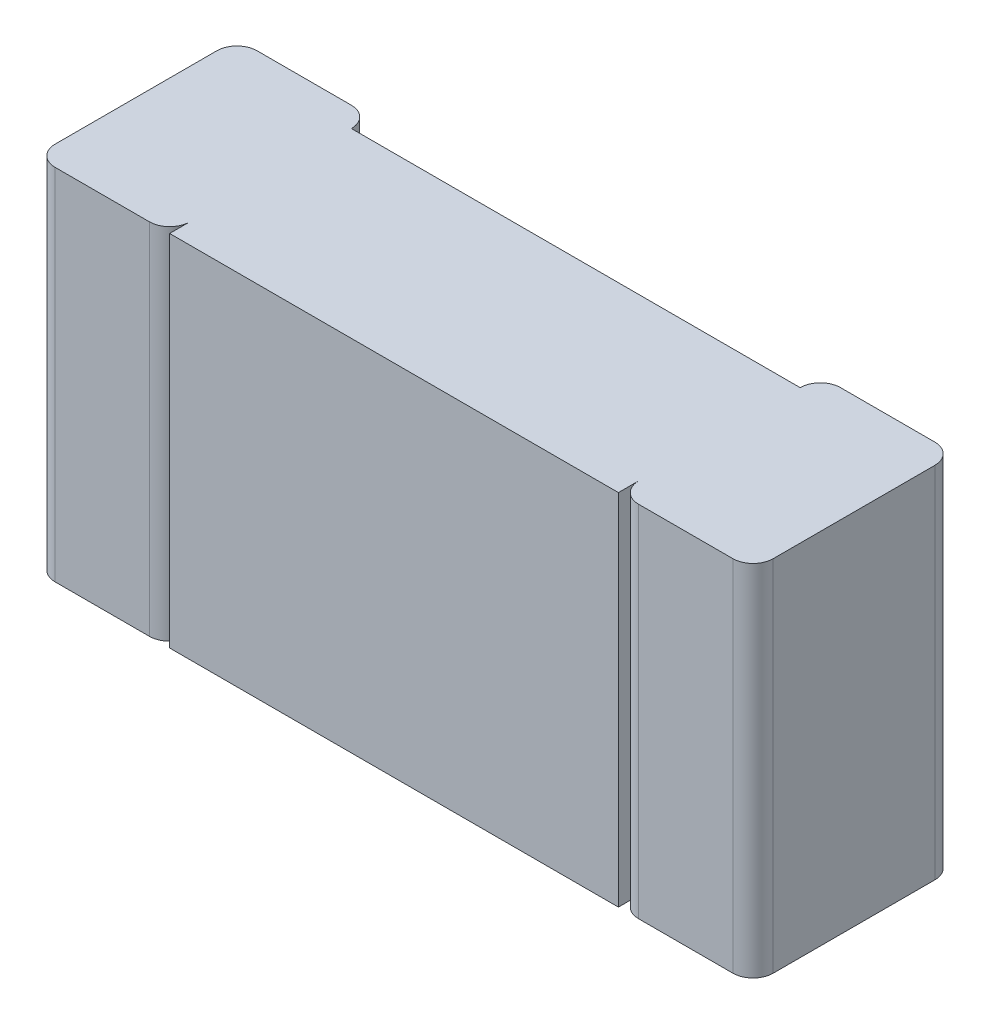
ISO-10303-21;
HEADER;
FILE_DESCRIPTION(('STEP AP214'),'2;1');
FILE_NAME('part.step','',(''),(''),'','','');
FILE_SCHEMA(('AUTOMOTIVE_DESIGN { 1 0 10303 214 1 1 1 1 }'));
ENDSEC;
DATA;
#1=APPLICATION_CONTEXT('core data for automotive mechanical design processes');
#2=APPLICATION_PROTOCOL_DEFINITION('international standard','automotive_design',2000,#1);
#3=PRODUCT_CONTEXT('',#1,'mechanical');
#4=PRODUCT('Part','Part','',(#3));
#5=PRODUCT_RELATED_PRODUCT_CATEGORY('part','',(#4));
#6=PRODUCT_DEFINITION_FORMATION('','',#4);
#7=PRODUCT_DEFINITION_CONTEXT('part definition',#1,'design');
#8=PRODUCT_DEFINITION('design','',#6,#7);
#9=PRODUCT_DEFINITION_SHAPE('','',#8);
#10=(LENGTH_UNIT() NAMED_UNIT(*) SI_UNIT(.MILLI.,.METRE.));
#11=(NAMED_UNIT(*) PLANE_ANGLE_UNIT() SI_UNIT($,.RADIAN.));
#12=(NAMED_UNIT(*) SI_UNIT($,.STERADIAN.) SOLID_ANGLE_UNIT());
#13=UNCERTAINTY_MEASURE_WITH_UNIT(LENGTH_MEASURE(1.E-05),#10,'distance_accuracy_value','');
#14=(GEOMETRIC_REPRESENTATION_CONTEXT(3) GLOBAL_UNCERTAINTY_ASSIGNED_CONTEXT((#13)) GLOBAL_UNIT_ASSIGNED_CONTEXT((#10,
#11,#12)) REPRESENTATION_CONTEXT('',''));
#15=CARTESIAN_POINT('',(0.,0.,0.));
#16=DIRECTION('',(0.,0.,1.));
#17=DIRECTION('',(1.,0.,0.));
#18=AXIS2_PLACEMENT_3D('',#15,#16,#17);
#19=CARTESIAN_POINT('',(-0.5,-0.4,0.45));
#20=DIRECTION('',(0.,0.,1.));
#21=DIRECTION('',(1.,0.,0.));
#22=AXIS2_PLACEMENT_3D('',#19,#20,#21);
#23=PLANE('',#22);
#24=DIRECTION('',(0.,1.,0.));
#25=VECTOR('',#24,1.);
#26=CARTESIAN_POINT('',(-0.5,-0.4,0.45));
#27=LINE('',#26,#25);
#28=CARTESIAN_POINT('',(-0.5,-0.4,0.45));
#29=VERTEX_POINT('',#28);
#30=CARTESIAN_POINT('',(-0.5,0.4,0.45));
#31=VERTEX_POINT('',#30);
#32=EDGE_CURVE('E356',#29,#31,#27,.T.);
#33=ORIENTED_EDGE('',*,*,#32,.F.);
#34=DIRECTION('',(1.,0.,0.));
#35=VECTOR('',#34,1.);
#36=CARTESIAN_POINT('',(-0.5,-0.4,0.45));
#37=LINE('',#36,#35);
#38=CARTESIAN_POINT('',(0.5,-0.4,0.45));
#39=VERTEX_POINT('',#38);
#40=EDGE_CURVE('E227',#29,#39,#37,.T.);
#41=ORIENTED_EDGE('',*,*,#40,.T.);
#42=DIRECTION('',(0.,1.,0.));
#43=VECTOR('',#42,1.);
#44=CARTESIAN_POINT('',(0.5,-0.4,0.45));
#45=LINE('',#44,#43);
#46=CARTESIAN_POINT('',(0.5,0.4,0.45));
#47=VERTEX_POINT('',#46);
#48=EDGE_CURVE('E11',#39,#47,#45,.T.);
#49=ORIENTED_EDGE('',*,*,#48,.T.);
#50=DIRECTION('',(1.,0.,0.));
#51=VECTOR('',#50,1.);
#52=CARTESIAN_POINT('',(-0.5,0.4,0.45));
#53=LINE('',#52,#51);
#54=EDGE_CURVE('E286',#31,#47,#53,.T.);
#55=ORIENTED_EDGE('',*,*,#54,.F.);
#56=EDGE_LOOP('',(#33,#41,#49,#55));
#57=FACE_BOUND('',#56,.T.);
#58=ADVANCED_FACE('F17',(#57),#23,.T.);
#59=CARTESIAN_POINT('',(0.5,-0.4,0.405));
#60=DIRECTION('',(1.,0.,0.));
#61=DIRECTION('',(0.,1.,0.));
#62=AXIS2_PLACEMENT_3D('',#59,#60,#61);
#63=PLANE('',#62);
#64=DIRECTION('',(0.,0.,1.));
#65=VECTOR('',#64,1.);
#66=CARTESIAN_POINT('',(0.5,-0.4,0.405));
#67=LINE('',#66,#65);
#68=CARTESIAN_POINT('',(0.5,-0.4,0.405));
#69=VERTEX_POINT('',#68);
#70=EDGE_CURVE('E231',#69,#39,#67,.T.);
#71=ORIENTED_EDGE('',*,*,#70,.F.);
#72=DIRECTION('',(0.,1.,0.));
#73=VECTOR('',#72,1.);
#74=CARTESIAN_POINT('',(0.5,-0.4,0.405));
#75=LINE('',#74,#73);
#76=CARTESIAN_POINT('',(0.5,0.4,0.405));
#77=VERTEX_POINT('',#76);
#78=EDGE_CURVE('E25',#69,#77,#75,.T.);
#79=ORIENTED_EDGE('',*,*,#78,.T.);
#80=DIRECTION('',(0.,0.,1.));
#81=VECTOR('',#80,1.);
#82=CARTESIAN_POINT('',(0.5,0.4,0.405));
#83=LINE('',#82,#81);
#84=EDGE_CURVE('E282',#77,#47,#83,.T.);
#85=ORIENTED_EDGE('',*,*,#84,.T.);
#86=ORIENTED_EDGE('',*,*,#48,.F.);
#87=EDGE_LOOP('',(#71,#79,#85,#86));
#88=FACE_BOUND('',#87,.T.);
#89=ADVANCED_FACE('F403',(#88),#63,.T.);
#90=CARTESIAN_POINT('',(0.545,-0.4,0.405));
#91=DIRECTION('',(0.,1.,0.));
#92=DIRECTION('',(-1.,0.,0.));
#93=AXIS2_PLACEMENT_3D('',#90,#91,#92);
#94=CYLINDRICAL_SURFACE('',#93,0.045);
#95=CARTESIAN_POINT('',(0.545,-0.4,0.405));
#96=DIRECTION('',(0.,1.,0.));
#97=DIRECTION('',(0.,0.,1.));
#98=AXIS2_PLACEMENT_3D('',#95,#96,#97);
#99=CIRCLE('',#98,0.045);
#100=CARTESIAN_POINT('',(0.545,-0.4,0.45));
#101=VERTEX_POINT('',#100);
#102=EDGE_CURVE('E335',#69,#101,#99,.T.);
#103=ORIENTED_EDGE('',*,*,#102,.T.);
#104=DIRECTION('',(0.,1.,0.));
#105=VECTOR('',#104,1.);
#106=CARTESIAN_POINT('',(0.545,-0.4,0.45));
#107=LINE('',#106,#105);
#108=CARTESIAN_POINT('',(0.545,0.4,0.45));
#109=VERTEX_POINT('',#108);
#110=EDGE_CURVE('E346',#101,#109,#107,.T.);
#111=ORIENTED_EDGE('',*,*,#110,.T.);
#112=CARTESIAN_POINT('',(0.545,0.4,0.405));
#113=DIRECTION('',(0.,1.,0.));
#114=DIRECTION('',(0.,0.,1.));
#115=AXIS2_PLACEMENT_3D('',#112,#113,#114);
#116=CIRCLE('',#115,0.045);
#117=EDGE_CURVE('E314',#77,#109,#116,.T.);
#118=ORIENTED_EDGE('',*,*,#117,.F.);
#119=ORIENTED_EDGE('',*,*,#78,.F.);
#120=EDGE_LOOP('',(#103,#111,#118,#119));
#121=FACE_BOUND('',#120,.T.);
#122=ADVANCED_FACE('F391',(#121),#94,.T.);
#123=CARTESIAN_POINT('',(0.5,-0.4,0.45));
#124=DIRECTION('',(0.,0.,1.));
#125=DIRECTION('',(1.,0.,0.));
#126=AXIS2_PLACEMENT_3D('',#123,#124,#125);
#127=PLANE('',#126);
#128=DIRECTION('',(1.,0.,0.));
#129=VECTOR('',#128,1.);
#130=CARTESIAN_POINT('',(0.5,0.4,0.45));
#131=LINE('',#130,#129);
#132=CARTESIAN_POINT('',(0.755,0.4,0.45));
#133=VERTEX_POINT('',#132);
#134=EDGE_CURVE('E243',#109,#133,#131,.T.);
#135=ORIENTED_EDGE('',*,*,#134,.F.);
#136=ORIENTED_EDGE('',*,*,#110,.F.);
#137=DIRECTION('',(1.,0.,0.));
#138=VECTOR('',#137,1.);
#139=CARTESIAN_POINT('',(0.5,-0.4,0.45));
#140=LINE('',#139,#138);
#141=CARTESIAN_POINT('',(0.755,-0.4,0.45));
#142=VERTEX_POINT('',#141);
#143=EDGE_CURVE('E331',#101,#142,#140,.T.);
#144=ORIENTED_EDGE('',*,*,#143,.T.);
#145=DIRECTION('',(0.,1.,0.));
#146=VECTOR('',#145,1.);
#147=CARTESIAN_POINT('',(0.755,-0.4,0.45));
#148=LINE('',#147,#146);
#149=EDGE_CURVE('E368',#142,#133,#148,.T.);
#150=ORIENTED_EDGE('',*,*,#149,.T.);
#151=EDGE_LOOP('',(#135,#136,#144,#150));
#152=FACE_BOUND('',#151,.T.);
#153=ADVANCED_FACE('F395',(#152),#127,.T.);
#154=CARTESIAN_POINT('',(0.755,-0.4,0.405));
#155=DIRECTION('',(0.,1.,0.));
#156=DIRECTION('',(1.,0.,0.));
#157=AXIS2_PLACEMENT_3D('',#154,#155,#156);
#158=CYLINDRICAL_SURFACE('',#157,0.045);
#159=DIRECTION('',(0.,1.,0.));
#160=VECTOR('',#159,1.);
#161=CARTESIAN_POINT('',(0.8,-0.4,0.405));
#162=LINE('',#161,#160);
#163=CARTESIAN_POINT('',(0.8,-0.4,0.405));
#164=VERTEX_POINT('',#163);
#165=CARTESIAN_POINT('',(0.8,0.4,0.405));
#166=VERTEX_POINT('',#165);
#167=EDGE_CURVE('E272',#164,#166,#162,.T.);
#168=ORIENTED_EDGE('',*,*,#167,.T.);
#169=CARTESIAN_POINT('',(0.755,0.4,0.405));
#170=DIRECTION('',(0.,-1.,0.));
#171=DIRECTION('',(0.,0.,1.));
#172=AXIS2_PLACEMENT_3D('',#169,#170,#171);
#173=CIRCLE('',#172,0.045);
#174=EDGE_CURVE('E238',#166,#133,#173,.T.);
#175=ORIENTED_EDGE('',*,*,#174,.T.);
#176=ORIENTED_EDGE('',*,*,#149,.F.);
#177=CARTESIAN_POINT('',(0.755,-0.4,0.405));
#178=DIRECTION('',(0.,-1.,0.));
#179=DIRECTION('',(0.,0.,1.));
#180=AXIS2_PLACEMENT_3D('',#177,#178,#179);
#181=CIRCLE('',#180,0.045);
#182=EDGE_CURVE('E330',#164,#142,#181,.T.);
#183=ORIENTED_EDGE('',*,*,#182,.F.);
#184=EDGE_LOOP('',(#168,#175,#176,#183));
#185=FACE_BOUND('',#184,.T.);
#186=ADVANCED_FACE('F434',(#185),#158,.T.);
#187=CARTESIAN_POINT('',(0.8,-0.4,0.));
#188=DIRECTION('',(1.,0.,0.));
#189=DIRECTION('',(0.,1.,0.));
#190=AXIS2_PLACEMENT_3D('',#187,#188,#189);
#191=PLANE('',#190);
#192=DIRECTION('',(0.,0.,1.));
#193=VECTOR('',#192,1.);
#194=CARTESIAN_POINT('',(0.8,-0.4,0.));
#195=LINE('',#194,#193);
#196=CARTESIAN_POINT('',(0.8,-0.4,0.045));
#197=VERTEX_POINT('',#196);
#198=EDGE_CURVE('E326',#197,#164,#195,.T.);
#199=ORIENTED_EDGE('',*,*,#198,.F.);
#200=DIRECTION('',(0.,1.,0.));
#201=VECTOR('',#200,1.);
#202=CARTESIAN_POINT('',(0.8,-0.4,0.045));
#203=LINE('',#202,#201);
#204=CARTESIAN_POINT('',(0.8,0.4,0.045));
#205=VERTEX_POINT('',#204);
#206=EDGE_CURVE('E45',#197,#205,#203,.T.);
#207=ORIENTED_EDGE('',*,*,#206,.T.);
#208=DIRECTION('',(0.,0.,1.));
#209=VECTOR('',#208,1.);
#210=CARTESIAN_POINT('',(0.8,0.4,0.));
#211=LINE('',#210,#209);
#212=EDGE_CURVE('E242',#205,#166,#211,.T.);
#213=ORIENTED_EDGE('',*,*,#212,.T.);
#214=ORIENTED_EDGE('',*,*,#167,.F.);
#215=EDGE_LOOP('',(#199,#207,#213,#214));
#216=FACE_BOUND('',#215,.T.);
#217=ADVANCED_FACE('F433',(#216),#191,.T.);
#218=CARTESIAN_POINT('',(0.755,-0.4,0.045));
#219=DIRECTION('',(0.,1.,0.));
#220=DIRECTION('',(1.,0.,0.));
#221=AXIS2_PLACEMENT_3D('',#218,#219,#220);
#222=CYLINDRICAL_SURFACE('',#221,0.045);
#223=CARTESIAN_POINT('',(0.755,-0.4,0.045));
#224=DIRECTION('',(0.,1.,0.));
#225=DIRECTION('',(0.,0.,1.));
#226=AXIS2_PLACEMENT_3D('',#223,#224,#225);
#227=CIRCLE('',#226,0.045);
#228=CARTESIAN_POINT('',(0.755,-0.4,0.));
#229=VERTEX_POINT('',#228);
#230=EDGE_CURVE('E322',#197,#229,#227,.T.);
#231=ORIENTED_EDGE('',*,*,#230,.T.);
#232=DIRECTION('',(0.,1.,0.));
#233=VECTOR('',#232,1.);
#234=CARTESIAN_POINT('',(0.755,-0.4,0.));
#235=LINE('',#234,#233);
#236=CARTESIAN_POINT('',(0.755,0.4,0.));
#237=VERTEX_POINT('',#236);
#238=EDGE_CURVE('E273',#229,#237,#235,.T.);
#239=ORIENTED_EDGE('',*,*,#238,.T.);
#240=CARTESIAN_POINT('',(0.755,0.4,0.045));
#241=DIRECTION('',(0.,1.,0.));
#242=DIRECTION('',(0.,0.,1.));
#243=AXIS2_PLACEMENT_3D('',#240,#241,#242);
#244=CIRCLE('',#243,0.045);
#245=EDGE_CURVE('E374',#205,#237,#244,.T.);
#246=ORIENTED_EDGE('',*,*,#245,.F.);
#247=ORIENTED_EDGE('',*,*,#206,.F.);
#248=EDGE_LOOP('',(#231,#239,#246,#247));
#249=FACE_BOUND('',#248,.T.);
#250=ADVANCED_FACE('F431',(#249),#222,.T.);
#251=CARTESIAN_POINT('',(0.5,-0.4,0.));
#252=DIRECTION('',(0.,0.,1.));
#253=DIRECTION('',(1.,0.,0.));
#254=AXIS2_PLACEMENT_3D('',#251,#252,#253);
#255=PLANE('',#254);
#256=ORIENTED_EDGE('',*,*,#238,.F.);
#257=DIRECTION('',(1.,0.,0.));
#258=VECTOR('',#257,1.);
#259=CARTESIAN_POINT('',(0.5,-0.4,0.));
#260=LINE('',#259,#258);
#261=CARTESIAN_POINT('',(0.545,-0.4,0.));
#262=VERTEX_POINT('',#261);
#263=EDGE_CURVE('E343',#262,#229,#260,.T.);
#264=ORIENTED_EDGE('',*,*,#263,.F.);
#265=DIRECTION('',(0.,1.,0.));
#266=VECTOR('',#265,1.);
#267=CARTESIAN_POINT('',(0.545,-0.4,0.));
#268=LINE('',#267,#266);
#269=CARTESIAN_POINT('',(0.545,0.4,0.));
#270=VERTEX_POINT('',#269);
#271=EDGE_CURVE('E285',#262,#270,#268,.T.);
#272=ORIENTED_EDGE('',*,*,#271,.T.);
#273=DIRECTION('',(1.,0.,0.));
#274=VECTOR('',#273,1.);
#275=CARTESIAN_POINT('',(0.5,0.4,0.));
#276=LINE('',#275,#274);
#277=EDGE_CURVE('E301',#270,#237,#276,.T.);
#278=ORIENTED_EDGE('',*,*,#277,.T.);
#279=EDGE_LOOP('',(#256,#264,#272,#278));
#280=FACE_BOUND('',#279,.T.);
#281=ADVANCED_FACE('F429',(#280),#255,.F.);
#282=CARTESIAN_POINT('',(0.545,-0.4,0.045));
#283=DIRECTION('',(0.,1.,0.));
#284=DIRECTION('',(-1.,0.,0.));
#285=AXIS2_PLACEMENT_3D('',#282,#283,#284);
#286=CYLINDRICAL_SURFACE('',#285,0.045);
#287=DIRECTION('',(0.,1.,0.));
#288=VECTOR('',#287,1.);
#289=CARTESIAN_POINT('',(0.5,-0.4,0.045));
#290=LINE('',#289,#288);
#291=CARTESIAN_POINT('',(0.5,-0.4,0.045));
#292=VERTEX_POINT('',#291);
#293=CARTESIAN_POINT('',(0.5,0.4,0.045));
#294=VERTEX_POINT('',#293);
#295=EDGE_CURVE('E318',#292,#294,#290,.T.);
#296=ORIENTED_EDGE('',*,*,#295,.T.);
#297=CARTESIAN_POINT('',(0.545,0.4,0.045));
#298=DIRECTION('',(0.,-1.,0.));
#299=DIRECTION('',(0.,0.,1.));
#300=AXIS2_PLACEMENT_3D('',#297,#298,#299);
#301=CIRCLE('',#300,0.045);
#302=EDGE_CURVE('E305',#294,#270,#301,.T.);
#303=ORIENTED_EDGE('',*,*,#302,.T.);
#304=ORIENTED_EDGE('',*,*,#271,.F.);
#305=CARTESIAN_POINT('',(0.545,-0.4,0.045));
#306=DIRECTION('',(0.,-1.,0.));
#307=DIRECTION('',(0.,0.,1.));
#308=AXIS2_PLACEMENT_3D('',#305,#306,#307);
#309=CIRCLE('',#308,0.045);
#310=EDGE_CURVE('E339',#292,#262,#309,.T.);
#311=ORIENTED_EDGE('',*,*,#310,.F.);
#312=EDGE_LOOP('',(#296,#303,#304,#311));
#313=FACE_BOUND('',#312,.T.);
#314=ADVANCED_FACE('F426',(#313),#286,.T.);
#315=CARTESIAN_POINT('',(-0.5,-0.4,0.405));
#316=DIRECTION('',(1.,0.,0.));
#317=DIRECTION('',(0.,1.,0.));
#318=AXIS2_PLACEMENT_3D('',#315,#316,#317);
#319=PLANE('',#318);
#320=ORIENTED_EDGE('',*,*,#32,.T.);
#321=DIRECTION('',(0.,0.,1.));
#322=VECTOR('',#321,1.);
#323=CARTESIAN_POINT('',(-0.5,0.4,0.405));
#324=LINE('',#323,#322);
#325=CARTESIAN_POINT('',(-0.5,0.4,0.405));
#326=VERTEX_POINT('',#325);
#327=EDGE_CURVE('E306',#326,#31,#324,.T.);
#328=ORIENTED_EDGE('',*,*,#327,.F.);
#329=DIRECTION('',(0.,1.,0.));
#330=VECTOR('',#329,1.);
#331=CARTESIAN_POINT('',(-0.5,-0.4,0.405));
#332=LINE('',#331,#330);
#333=CARTESIAN_POINT('',(-0.5,-0.4,0.405));
#334=VERTEX_POINT('',#333);
#335=EDGE_CURVE('E300',#334,#326,#332,.T.);
#336=ORIENTED_EDGE('',*,*,#335,.F.);
#337=DIRECTION('',(0.,0.,1.));
#338=VECTOR('',#337,1.);
#339=CARTESIAN_POINT('',(-0.5,-0.4,0.405));
#340=LINE('',#339,#338);
#341=EDGE_CURVE('E230',#334,#29,#340,.T.);
#342=ORIENTED_EDGE('',*,*,#341,.T.);
#343=EDGE_LOOP('',(#320,#328,#336,#342));
#344=FACE_BOUND('',#343,.T.);
#345=ADVANCED_FACE('F450',(#344),#319,.F.);
#346=CARTESIAN_POINT('',(-0.755,-0.4,0.045));
#347=DIRECTION('',(0.,0.,1.));
#348=DIRECTION('',(1.,0.,0.));
#349=AXIS2_PLACEMENT_3D('',#346,#347,#348);
#350=PLANE('',#349);
#351=DIRECTION('',(1.,0.,0.));
#352=VECTOR('',#351,1.);
#353=CARTESIAN_POINT('',(-0.755,0.4,0.045));
#354=LINE('',#353,#352);
#355=CARTESIAN_POINT('',(-0.5,0.4,0.045));
#356=VERTEX_POINT('',#355);
#357=EDGE_CURVE('E310',#356,#294,#354,.T.);
#358=ORIENTED_EDGE('',*,*,#357,.T.);
#359=ORIENTED_EDGE('',*,*,#295,.F.);
#360=DIRECTION('',(1.,0.,0.));
#361=VECTOR('',#360,1.);
#362=CARTESIAN_POINT('',(-0.755,-0.4,0.045));
#363=LINE('',#362,#361);
#364=CARTESIAN_POINT('',(-0.5,-0.4,0.045));
#365=VERTEX_POINT('',#364);
#366=EDGE_CURVE('E293',#365,#292,#363,.T.);
#367=ORIENTED_EDGE('',*,*,#366,.F.);
#368=DIRECTION('',(0.,1.,0.));
#369=VECTOR('',#368,1.);
#370=CARTESIAN_POINT('',(-0.5,-0.4,0.045));
#371=LINE('',#370,#369);
#372=EDGE_CURVE('E289',#365,#356,#371,.T.);
#373=ORIENTED_EDGE('',*,*,#372,.T.);
#374=EDGE_LOOP('',(#358,#359,#367,#373));
#375=FACE_BOUND('',#374,.T.);
#376=ADVANCED_FACE('F422',(#375),#350,.F.);
#377=CARTESIAN_POINT('',(-0.545,-0.4,0.405));
#378=DIRECTION('',(0.,1.,0.));
#379=DIRECTION('',(1.,0.,0.));
#380=AXIS2_PLACEMENT_3D('',#377,#378,#379);
#381=CYLINDRICAL_SURFACE('',#380,0.045);
#382=ORIENTED_EDGE('',*,*,#335,.T.);
#383=CARTESIAN_POINT('',(-0.545,0.4,0.405));
#384=DIRECTION('',(0.,-1.,0.));
#385=DIRECTION('',(0.,0.,1.));
#386=AXIS2_PLACEMENT_3D('',#383,#384,#385);
#387=CIRCLE('',#386,0.045);
#388=CARTESIAN_POINT('',(-0.545,0.4,0.45));
#389=VERTEX_POINT('',#388);
#390=EDGE_CURVE('E267',#326,#389,#387,.T.);
#391=ORIENTED_EDGE('',*,*,#390,.T.);
#392=DIRECTION('',(0.,1.,0.));
#393=VECTOR('',#392,1.);
#394=CARTESIAN_POINT('',(-0.545,-0.4,0.45));
#395=LINE('',#394,#393);
#396=CARTESIAN_POINT('',(-0.545,-0.4,0.45));
#397=VERTEX_POINT('',#396);
#398=EDGE_CURVE('E297',#397,#389,#395,.T.);
#399=ORIENTED_EDGE('',*,*,#398,.F.);
#400=CARTESIAN_POINT('',(-0.545,-0.4,0.405));
#401=DIRECTION('',(0.,-1.,0.));
#402=DIRECTION('',(0.,0.,1.));
#403=AXIS2_PLACEMENT_3D('',#400,#401,#402);
#404=CIRCLE('',#403,0.045);
#405=EDGE_CURVE('E237',#334,#397,#404,.T.);
#406=ORIENTED_EDGE('',*,*,#405,.F.);
#407=EDGE_LOOP('',(#382,#391,#399,#406));
#408=FACE_BOUND('',#407,.T.);
#409=ADVANCED_FACE('F453',(#408),#381,.T.);
#410=CARTESIAN_POINT('',(-0.8,-0.4,0.45));
#411=DIRECTION('',(0.,0.,1.));
#412=DIRECTION('',(1.,0.,0.));
#413=AXIS2_PLACEMENT_3D('',#410,#411,#412);
#414=PLANE('',#413);
#415=DIRECTION('',(1.,0.,0.));
#416=VECTOR('',#415,1.);
#417=CARTESIAN_POINT('',(-0.8,0.4,0.45));
#418=LINE('',#417,#416);
#419=CARTESIAN_POINT('',(-0.755,0.4,0.45));
#420=VERTEX_POINT('',#419);
#421=EDGE_CURVE('E256',#420,#389,#418,.T.);
#422=ORIENTED_EDGE('',*,*,#421,.F.);
#423=DIRECTION('',(0.,1.,0.));
#424=VECTOR('',#423,1.);
#425=CARTESIAN_POINT('',(-0.755,-0.4,0.45));
#426=LINE('',#425,#424);
#427=CARTESIAN_POINT('',(-0.755,-0.4,0.45));
#428=VERTEX_POINT('',#427);
#429=EDGE_CURVE('E261',#428,#420,#426,.T.);
#430=ORIENTED_EDGE('',*,*,#429,.F.);
#431=DIRECTION('',(1.,0.,0.));
#432=VECTOR('',#431,1.);
#433=CARTESIAN_POINT('',(-0.8,-0.4,0.45));
#434=LINE('',#433,#432);
#435=EDGE_CURVE('E193',#428,#397,#434,.T.);
#436=ORIENTED_EDGE('',*,*,#435,.T.);
#437=ORIENTED_EDGE('',*,*,#398,.T.);
#438=EDGE_LOOP('',(#422,#430,#436,#437));
#439=FACE_BOUND('',#438,.T.);
#440=ADVANCED_FACE('F455',(#439),#414,.T.);
#441=CARTESIAN_POINT('',(-0.545,-0.4,0.045));
#442=DIRECTION('',(0.,1.,0.));
#443=DIRECTION('',(1.,0.,0.));
#444=AXIS2_PLACEMENT_3D('',#441,#442,#443);
#445=CYLINDRICAL_SURFACE('',#444,0.045);
#446=CARTESIAN_POINT('',(-0.545,-0.4,0.045));
#447=DIRECTION('',(0.,1.,0.));
#448=DIRECTION('',(0.,0.,1.));
#449=AXIS2_PLACEMENT_3D('',#446,#447,#448);
#450=CIRCLE('',#449,0.045);
#451=CARTESIAN_POINT('',(-0.545,-0.4,0.));
#452=VERTEX_POINT('',#451);
#453=EDGE_CURVE('E208',#365,#452,#450,.T.);
#454=ORIENTED_EDGE('',*,*,#453,.T.);
#455=DIRECTION('',(0.,1.,0.));
#456=VECTOR('',#455,1.);
#457=CARTESIAN_POINT('',(-0.545,-0.4,0.));
#458=LINE('',#457,#456);
#459=CARTESIAN_POINT('',(-0.545,0.4,0.));
#460=VERTEX_POINT('',#459);
#461=EDGE_CURVE('E266',#452,#460,#458,.T.);
#462=ORIENTED_EDGE('',*,*,#461,.T.);
#463=CARTESIAN_POINT('',(-0.545,0.4,0.045));
#464=DIRECTION('',(0.,1.,0.));
#465=DIRECTION('',(0.,0.,1.));
#466=AXIS2_PLACEMENT_3D('',#463,#464,#465);
#467=CIRCLE('',#466,0.045);
#468=EDGE_CURVE('E262',#356,#460,#467,.T.);
#469=ORIENTED_EDGE('',*,*,#468,.F.);
#470=ORIENTED_EDGE('',*,*,#372,.F.);
#471=EDGE_LOOP('',(#454,#462,#469,#470));
#472=FACE_BOUND('',#471,.T.);
#473=ADVANCED_FACE('F419',(#472),#445,.T.);
#474=CARTESIAN_POINT('',(-0.8,-0.4,0.));
#475=DIRECTION('',(0.,0.,1.));
#476=DIRECTION('',(1.,0.,0.));
#477=AXIS2_PLACEMENT_3D('',#474,#475,#476);
#478=PLANE('',#477);
#479=ORIENTED_EDGE('',*,*,#461,.F.);
#480=DIRECTION('',(1.,0.,0.));
#481=VECTOR('',#480,1.);
#482=CARTESIAN_POINT('',(-0.8,-0.4,0.));
#483=LINE('',#482,#481);
#484=CARTESIAN_POINT('',(-0.755,-0.4,0.));
#485=VERTEX_POINT('',#484);
#486=EDGE_CURVE('E222',#485,#452,#483,.T.);
#487=ORIENTED_EDGE('',*,*,#486,.F.);
#488=DIRECTION('',(0.,1.,0.));
#489=VECTOR('',#488,1.);
#490=CARTESIAN_POINT('',(-0.755,-0.4,0.));
#491=LINE('',#490,#489);
#492=CARTESIAN_POINT('',(-0.755,0.4,0.));
#493=VERTEX_POINT('',#492);
#494=EDGE_CURVE('E248',#485,#493,#491,.T.);
#495=ORIENTED_EDGE('',*,*,#494,.T.);
#496=DIRECTION('',(1.,0.,0.));
#497=VECTOR('',#496,1.);
#498=CARTESIAN_POINT('',(-0.8,0.4,0.));
#499=LINE('',#498,#497);
#500=EDGE_CURVE('E253',#493,#460,#499,.T.);
#501=ORIENTED_EDGE('',*,*,#500,.T.);
#502=EDGE_LOOP('',(#479,#487,#495,#501));
#503=FACE_BOUND('',#502,.T.);
#504=ADVANCED_FACE('F458',(#503),#478,.F.);
#505=CARTESIAN_POINT('',(-0.8,0.4,0.));
#506=DIRECTION('',(0.,1.,0.));
#507=DIRECTION('',(1.,0.,0.));
#508=AXIS2_PLACEMENT_3D('',#505,#506,#507);
#509=PLANE('',#508);
#510=ORIENTED_EDGE('',*,*,#390,.F.);
#511=ORIENTED_EDGE('',*,*,#327,.T.);
#512=ORIENTED_EDGE('',*,*,#54,.T.);
#513=ORIENTED_EDGE('',*,*,#84,.F.);
#514=ORIENTED_EDGE('',*,*,#117,.T.);
#515=ORIENTED_EDGE('',*,*,#134,.T.);
#516=ORIENTED_EDGE('',*,*,#174,.F.);
#517=ORIENTED_EDGE('',*,*,#212,.F.);
#518=ORIENTED_EDGE('',*,*,#245,.T.);
#519=ORIENTED_EDGE('',*,*,#277,.F.);
#520=ORIENTED_EDGE('',*,*,#302,.F.);
#521=ORIENTED_EDGE('',*,*,#357,.F.);
#522=ORIENTED_EDGE('',*,*,#468,.T.);
#523=ORIENTED_EDGE('',*,*,#500,.F.);
#524=CARTESIAN_POINT('',(-0.755,0.4,0.045));
#525=DIRECTION('',(0.,-1.,0.));
#526=DIRECTION('',(0.,0.,1.));
#527=AXIS2_PLACEMENT_3D('',#524,#525,#526);
#528=CIRCLE('',#527,0.045);
#529=CARTESIAN_POINT('',(-0.8,0.4,0.045));
#530=VERTEX_POINT('',#529);
#531=EDGE_CURVE('E244',#530,#493,#528,.T.);
#532=ORIENTED_EDGE('',*,*,#531,.F.);
#533=DIRECTION('',(0.,0.,1.));
#534=VECTOR('',#533,1.);
#535=CARTESIAN_POINT('',(-0.8,0.4,0.));
#536=LINE('',#535,#534);
#537=CARTESIAN_POINT('',(-0.8,0.4,0.405));
#538=VERTEX_POINT('',#537);
#539=EDGE_CURVE('E215',#530,#538,#536,.T.);
#540=ORIENTED_EDGE('',*,*,#539,.T.);
#541=CARTESIAN_POINT('',(-0.755,0.4,0.405));
#542=DIRECTION('',(0.,1.,0.));
#543=DIRECTION('',(0.,0.,1.));
#544=AXIS2_PLACEMENT_3D('',#541,#542,#543);
#545=CIRCLE('',#544,0.045);
#546=EDGE_CURVE('E212',#538,#420,#545,.T.);
#547=ORIENTED_EDGE('',*,*,#546,.T.);
#548=ORIENTED_EDGE('',*,*,#421,.T.);
#549=EDGE_LOOP('',(#510,#511,#512,#513,#514,#515,#516,#517,#518,#519,#520,#521,#522,#523,#532,
#540,#547,#548));
#550=FACE_BOUND('',#549,.T.);
#551=ADVANCED_FACE('F400',(#550),#509,.T.);
#552=CARTESIAN_POINT('',(-0.755,-0.4,0.405));
#553=DIRECTION('',(0.,1.,0.));
#554=DIRECTION('',(-1.,0.,0.));
#555=AXIS2_PLACEMENT_3D('',#552,#553,#554);
#556=CYLINDRICAL_SURFACE('',#555,0.045);
#557=CARTESIAN_POINT('',(-0.755,-0.4,0.405));
#558=DIRECTION('',(0.,1.,0.));
#559=DIRECTION('',(0.,0.,1.));
#560=AXIS2_PLACEMENT_3D('',#557,#558,#559);
#561=CIRCLE('',#560,0.045);
#562=CARTESIAN_POINT('',(-0.8,-0.4,0.405));
#563=VERTEX_POINT('',#562);
#564=EDGE_CURVE('E184',#563,#428,#561,.T.);
#565=ORIENTED_EDGE('',*,*,#564,.T.);
#566=ORIENTED_EDGE('',*,*,#429,.T.);
#567=ORIENTED_EDGE('',*,*,#546,.F.);
#568=DIRECTION('',(0.,1.,0.));
#569=VECTOR('',#568,1.);
#570=CARTESIAN_POINT('',(-0.8,-0.4,0.405));
#571=LINE('',#570,#569);
#572=EDGE_CURVE('E204',#563,#538,#571,.T.);
#573=ORIENTED_EDGE('',*,*,#572,.F.);
#574=EDGE_LOOP('',(#565,#566,#567,#573));
#575=FACE_BOUND('',#574,.T.);
#576=ADVANCED_FACE('F210',(#575),#556,.T.);
#577=CARTESIAN_POINT('',(-0.755,-0.4,0.045));
#578=DIRECTION('',(0.,1.,0.));
#579=DIRECTION('',(-1.,0.,0.));
#580=AXIS2_PLACEMENT_3D('',#577,#578,#579);
#581=CYLINDRICAL_SURFACE('',#580,0.045);
#582=DIRECTION('',(0.,1.,0.));
#583=VECTOR('',#582,1.);
#584=CARTESIAN_POINT('',(-0.8,-0.4,0.045));
#585=LINE('',#584,#583);
#586=CARTESIAN_POINT('',(-0.8,-0.4,0.045));
#587=VERTEX_POINT('',#586);
#588=EDGE_CURVE('E206',#587,#530,#585,.T.);
#589=ORIENTED_EDGE('',*,*,#588,.T.);
#590=ORIENTED_EDGE('',*,*,#531,.T.);
#591=ORIENTED_EDGE('',*,*,#494,.F.);
#592=CARTESIAN_POINT('',(-0.755,-0.4,0.045));
#593=DIRECTION('',(0.,-1.,0.));
#594=DIRECTION('',(0.,0.,1.));
#595=AXIS2_PLACEMENT_3D('',#592,#593,#594);
#596=CIRCLE('',#595,0.045);
#597=EDGE_CURVE('E198',#587,#485,#596,.T.);
#598=ORIENTED_EDGE('',*,*,#597,.F.);
#599=EDGE_LOOP('',(#589,#590,#591,#598));
#600=FACE_BOUND('',#599,.T.);
#601=ADVANCED_FACE('F457',(#600),#581,.T.);
#602=CARTESIAN_POINT('',(-0.8,-0.4,0.));
#603=DIRECTION('',(0.,1.,0.));
#604=DIRECTION('',(1.,0.,0.));
#605=AXIS2_PLACEMENT_3D('',#602,#603,#604);
#606=PLANE('',#605);
#607=ORIENTED_EDGE('',*,*,#453,.F.);
#608=ORIENTED_EDGE('',*,*,#366,.T.);
#609=ORIENTED_EDGE('',*,*,#310,.T.);
#610=ORIENTED_EDGE('',*,*,#263,.T.);
#611=ORIENTED_EDGE('',*,*,#230,.F.);
#612=ORIENTED_EDGE('',*,*,#198,.T.);
#613=ORIENTED_EDGE('',*,*,#182,.T.);
#614=ORIENTED_EDGE('',*,*,#143,.F.);
#615=ORIENTED_EDGE('',*,*,#102,.F.);
#616=ORIENTED_EDGE('',*,*,#70,.T.);
#617=ORIENTED_EDGE('',*,*,#40,.F.);
#618=ORIENTED_EDGE('',*,*,#341,.F.);
#619=ORIENTED_EDGE('',*,*,#405,.T.);
#620=ORIENTED_EDGE('',*,*,#435,.F.);
#621=ORIENTED_EDGE('',*,*,#564,.F.);
#622=DIRECTION('',(0.,0.,1.));
#623=VECTOR('',#622,1.);
#624=CARTESIAN_POINT('',(-0.8,-0.4,0.));
#625=LINE('',#624,#623);
#626=EDGE_CURVE('E189',#587,#563,#625,.T.);
#627=ORIENTED_EDGE('',*,*,#626,.F.);
#628=ORIENTED_EDGE('',*,*,#597,.T.);
#629=ORIENTED_EDGE('',*,*,#486,.T.);
#630=EDGE_LOOP('',(#607,#608,#609,#610,#611,#612,#613,#614,#615,#616,#617,#618,#619,#620,#621,
#627,#628,#629));
#631=FACE_BOUND('',#630,.T.);
#632=ADVANCED_FACE('F187',(#631),#606,.F.);
#633=CARTESIAN_POINT('',(-0.8,-0.4,0.));
#634=DIRECTION('',(1.,0.,0.));
#635=DIRECTION('',(0.,1.,0.));
#636=AXIS2_PLACEMENT_3D('',#633,#634,#635);
#637=PLANE('',#636);
#638=ORIENTED_EDGE('',*,*,#572,.T.);
#639=ORIENTED_EDGE('',*,*,#539,.F.);
#640=ORIENTED_EDGE('',*,*,#588,.F.);
#641=ORIENTED_EDGE('',*,*,#626,.T.);
#642=EDGE_LOOP('',(#638,#639,#640,#641));
#643=FACE_BOUND('',#642,.T.);
#644=ADVANCED_FACE('F202',(#643),#637,.F.);
#645=CLOSED_SHELL('',(#58,#89,#122,#153,#186,#217,#250,#281,#314,#345,#376,#409,#440,#473,#504,
#551,#576,#601,#632,#644));
#646=MANIFOLD_SOLID_BREP('B1',#645);
#647=ADVANCED_BREP_SHAPE_REPRESENTATION('',(#18,#646),#14);
#648=SHAPE_DEFINITION_REPRESENTATION(#9,#647);
ENDSEC;
END-ISO-10303-21;
